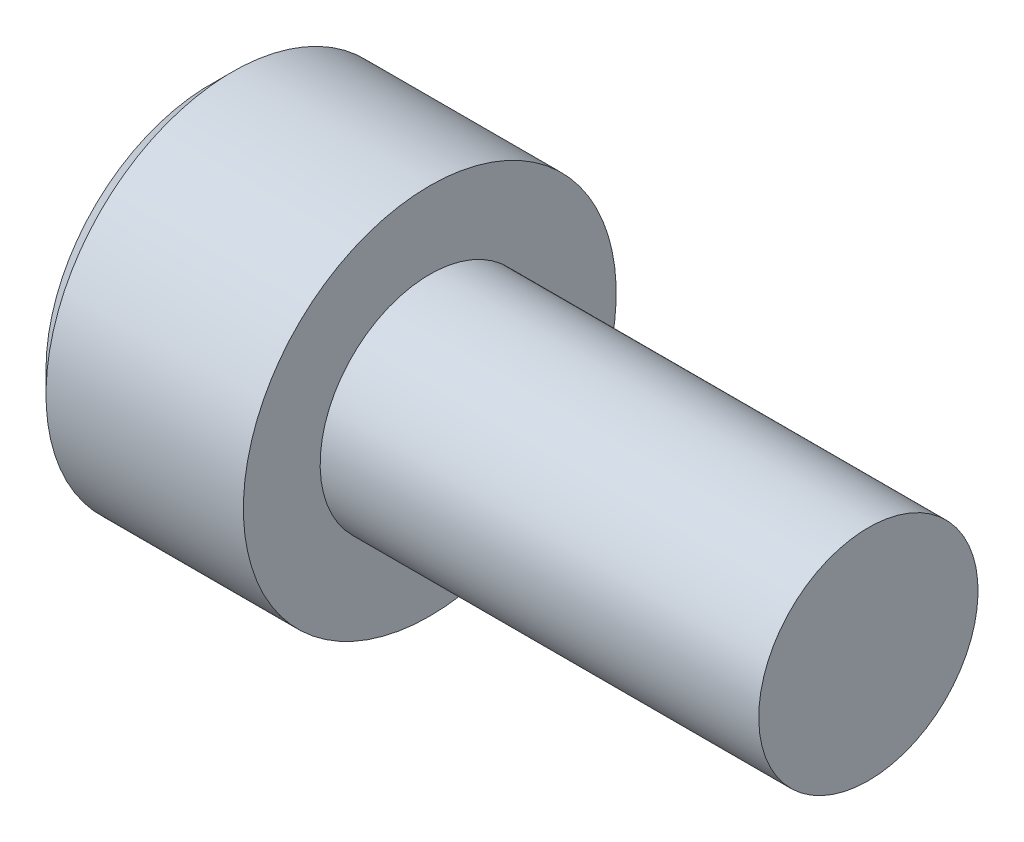
ISO-10303-21;
HEADER;
FILE_DESCRIPTION(('STEP AP214'),'2;1');
FILE_NAME('part.step','',(''),(''),'','','');
FILE_SCHEMA(('AUTOMOTIVE_DESIGN { 1 0 10303 214 1 1 1 1 }'));
ENDSEC;
DATA;
#1=APPLICATION_CONTEXT('core data for automotive mechanical design processes');
#2=APPLICATION_PROTOCOL_DEFINITION('international standard','automotive_design',2000,#1);
#3=PRODUCT_CONTEXT('',#1,'mechanical');
#4=PRODUCT('Part','Part','',(#3));
#5=PRODUCT_RELATED_PRODUCT_CATEGORY('part','',(#4));
#6=PRODUCT_DEFINITION_FORMATION('','',#4);
#7=PRODUCT_DEFINITION_CONTEXT('part definition',#1,'design');
#8=PRODUCT_DEFINITION('design','',#6,#7);
#9=PRODUCT_DEFINITION_SHAPE('','',#8);
#10=(LENGTH_UNIT() NAMED_UNIT(*) SI_UNIT(.MILLI.,.METRE.));
#11=(NAMED_UNIT(*) PLANE_ANGLE_UNIT() SI_UNIT($,.RADIAN.));
#12=(NAMED_UNIT(*) SI_UNIT($,.STERADIAN.) SOLID_ANGLE_UNIT());
#13=UNCERTAINTY_MEASURE_WITH_UNIT(LENGTH_MEASURE(1.E-05),#10,'distance_accuracy_value','');
#14=(GEOMETRIC_REPRESENTATION_CONTEXT(3) GLOBAL_UNCERTAINTY_ASSIGNED_CONTEXT((#13)) GLOBAL_UNIT_ASSIGNED_CONTEXT((#10,
#11,#12)) REPRESENTATION_CONTEXT('',''));
#15=CARTESIAN_POINT('',(0.,0.,0.));
#16=DIRECTION('',(0.,0.,1.));
#17=DIRECTION('',(1.,0.,0.));
#18=AXIS2_PLACEMENT_3D('',#15,#16,#17);
#19=CARTESIAN_POINT('',(-2.5,0.,0.));
#20=DIRECTION('',(-1.,0.,0.));
#21=DIRECTION('',(0.,0.,1.));
#22=AXIS2_PLACEMENT_3D('',#19,#20,#21);
#23=PLANE('',#22);
#24=CARTESIAN_POINT('',(-2.49999999999982,0.,0.));
#25=DIRECTION('',(-1.,0.,0.));
#26=DIRECTION('',(0.,-1.,0.));
#27=AXIS2_PLACEMENT_3D('',#24,#25,#26);
#28=CIRCLE('',#27,2.);
#29=CARTESIAN_POINT('',(-2.49999999999991,1.73205080756888,1.));
#30=VERTEX_POINT('',#29);
#31=CARTESIAN_POINT('',(-2.49999999999991,0.,2.));
#32=VERTEX_POINT('',#31);
#33=EDGE_CURVE('E18',#30,#32,#28,.F.);
#34=ORIENTED_EDGE('',*,*,#33,.T.);
#35=DIRECTION('',(0.,1.,0.));
#36=VECTOR('',#35,1.);
#37=CARTESIAN_POINT('',(-2.5,0.,2.));
#38=LINE('',#37,#36);
#39=CARTESIAN_POINT('',(-2.5,1.15470053837925,2.));
#40=VERTEX_POINT('',#39);
#41=EDGE_CURVE('E83',#32,#40,#38,.T.);
#42=ORIENTED_EDGE('',*,*,#41,.T.);
#43=DIRECTION('',(0.,0.499999999999999,-0.866025403784439));
#44=VECTOR('',#43,1.);
#45=CARTESIAN_POINT('',(-2.5,1.15470053837925,2.));
#46=LINE('',#45,#44);
#47=EDGE_CURVE('E103',#40,#30,#46,.T.);
#48=ORIENTED_EDGE('',*,*,#47,.T.);
#49=EDGE_LOOP('',(#34,#42,#48));
#50=FACE_BOUND('',#49,.T.);
#51=ADVANCED_FACE('F15',(#50),#23,.T.);
#52=CARTESIAN_POINT('',(-2.5,0.,0.));
#53=DIRECTION('',(-1.,0.,0.));
#54=DIRECTION('',(0.,0.,1.));
#55=AXIS2_PLACEMENT_3D('',#52,#53,#54);
#56=PLANE('',#55);
#57=CARTESIAN_POINT('',(-2.49999999999982,0.,0.));
#58=DIRECTION('',(-1.,0.,0.));
#59=DIRECTION('',(0.,-1.,0.));
#60=AXIS2_PLACEMENT_3D('',#57,#58,#59);
#61=CIRCLE('',#60,2.);
#62=CARTESIAN_POINT('',(-2.49999999999991,-1.73205080756888,1.));
#63=VERTEX_POINT('',#62);
#64=EDGE_CURVE('E113',#32,#63,#61,.F.);
#65=ORIENTED_EDGE('',*,*,#64,.T.);
#66=DIRECTION('',(0.,0.499999999999999,0.866025403784439));
#67=VECTOR('',#66,1.);
#68=CARTESIAN_POINT('',(-2.5,-1.73205080756888,1.));
#69=LINE('',#68,#67);
#70=CARTESIAN_POINT('',(-2.5,-1.15470053837925,2.));
#71=VERTEX_POINT('',#70);
#72=EDGE_CURVE('E121',#63,#71,#69,.T.);
#73=ORIENTED_EDGE('',*,*,#72,.T.);
#74=DIRECTION('',(0.,1.,0.));
#75=VECTOR('',#74,1.);
#76=CARTESIAN_POINT('',(-2.5,0.,2.));
#77=LINE('',#76,#75);
#78=EDGE_CURVE('E129',#71,#32,#77,.T.);
#79=ORIENTED_EDGE('',*,*,#78,.T.);
#80=EDGE_LOOP('',(#65,#73,#79));
#81=FACE_BOUND('',#80,.T.);
#82=ADVANCED_FACE('F365',(#81),#56,.T.);
#83=CARTESIAN_POINT('',(-2.5,0.,0.));
#84=DIRECTION('',(-1.,0.,0.));
#85=DIRECTION('',(0.,0.,1.));
#86=AXIS2_PLACEMENT_3D('',#83,#84,#85);
#87=PLANE('',#86);
#88=CARTESIAN_POINT('',(-2.49999999999982,0.,0.));
#89=DIRECTION('',(-1.,0.,0.));
#90=DIRECTION('',(0.,-1.,0.));
#91=AXIS2_PLACEMENT_3D('',#88,#89,#90);
#92=CIRCLE('',#91,2.);
#93=CARTESIAN_POINT('',(-2.49999999999991,0.,-2.));
#94=VERTEX_POINT('',#93);
#95=CARTESIAN_POINT('',(-2.49999999999991,1.73205080756888,-1.));
#96=VERTEX_POINT('',#95);
#97=EDGE_CURVE('E99',#94,#96,#92,.F.);
#98=ORIENTED_EDGE('',*,*,#97,.T.);
#99=DIRECTION('',(0.,-0.5,-0.866025403784439));
#100=VECTOR('',#99,1.);
#101=CARTESIAN_POINT('',(-2.5,1.73205080756888,-1.));
#102=LINE('',#101,#100);
#103=CARTESIAN_POINT('',(-2.5,1.15470053837925,-2.));
#104=VERTEX_POINT('',#103);
#105=EDGE_CURVE('E114',#96,#104,#102,.T.);
#106=ORIENTED_EDGE('',*,*,#105,.T.);
#107=DIRECTION('',(0.,1.,0.));
#108=VECTOR('',#107,1.);
#109=CARTESIAN_POINT('',(-2.5,0.,-2.));
#110=LINE('',#109,#108);
#111=EDGE_CURVE('E117',#104,#94,#110,.F.);
#112=ORIENTED_EDGE('',*,*,#111,.T.);
#113=EDGE_LOOP('',(#98,#106,#112));
#114=FACE_BOUND('',#113,.T.);
#115=ADVANCED_FACE('F356',(#114),#87,.T.);
#116=CARTESIAN_POINT('',(-2.49999999999995,0.,0.));
#117=DIRECTION('',(-1.,0.,0.));
#118=DIRECTION('',(0.,-1.,0.));
#119=AXIS2_PLACEMENT_3D('',#116,#117,#118);
#120=CONICAL_SURFACE('',#119,2.00000000000022,1.04719755119663);
#121=CARTESIAN_POINT('',(-1.3452994616206,2.22044604925031E-13,0.));
#122=VERTEX_POINT('',#121);
#123=VERTEX_LOOP('',#122);
#124=FACE_BOUND('',#123,.T.);
#125=ORIENTED_EDGE('',*,*,#33,.F.);
#126=CARTESIAN_POINT('',(-2.49999999999982,0.,0.));
#127=DIRECTION('',(-1.,0.,0.));
#128=DIRECTION('',(0.,-1.,0.));
#129=AXIS2_PLACEMENT_3D('',#126,#127,#128);
#130=CIRCLE('',#129,2.);
#131=EDGE_CURVE('E89',#96,#30,#130,.F.);
#132=ORIENTED_EDGE('',*,*,#131,.F.);
#133=ORIENTED_EDGE('',*,*,#97,.F.);
#134=CARTESIAN_POINT('',(-2.49999999999982,0.,0.));
#135=DIRECTION('',(-1.,0.,0.));
#136=DIRECTION('',(0.,-1.,0.));
#137=AXIS2_PLACEMENT_3D('',#134,#135,#136);
#138=CIRCLE('',#137,2.);
#139=CARTESIAN_POINT('',(-2.49999999999991,-1.73205080756888,-0.999999999999999));
#140=VERTEX_POINT('',#139);
#141=EDGE_CURVE('E151',#140,#94,#138,.F.);
#142=ORIENTED_EDGE('',*,*,#141,.F.);
#143=CARTESIAN_POINT('',(-2.49999999999982,0.,0.));
#144=DIRECTION('',(-1.,0.,0.));
#145=DIRECTION('',(0.,-1.,0.));
#146=AXIS2_PLACEMENT_3D('',#143,#144,#145);
#147=CIRCLE('',#146,2.);
#148=EDGE_CURVE('E115',#63,#140,#147,.F.);
#149=ORIENTED_EDGE('',*,*,#148,.F.);
#150=ORIENTED_EDGE('',*,*,#64,.F.);
#151=EDGE_LOOP('',(#125,#132,#133,#142,#149,#150));
#152=FACE_BOUND('',#151,.T.);
#153=ADVANCED_FACE('F111',(#124,#152),#120,.F.);
#154=CARTESIAN_POINT('',(-2.5,0.,0.));
#155=DIRECTION('',(-1.,0.,0.));
#156=DIRECTION('',(0.,0.,1.));
#157=AXIS2_PLACEMENT_3D('',#154,#155,#156);
#158=PLANE('',#157);
#159=ORIENTED_EDGE('',*,*,#141,.T.);
#160=DIRECTION('',(0.,1.,0.));
#161=VECTOR('',#160,1.);
#162=CARTESIAN_POINT('',(-2.5,1.15470053837925,-2.));
#163=LINE('',#162,#161);
#164=CARTESIAN_POINT('',(-2.5,-1.15470053837925,-2.));
#165=VERTEX_POINT('',#164);
#166=EDGE_CURVE('E153',#94,#165,#163,.F.);
#167=ORIENTED_EDGE('',*,*,#166,.T.);
#168=DIRECTION('',(0.,-0.499999999999999,0.866025403784439));
#169=VECTOR('',#168,1.);
#170=CARTESIAN_POINT('',(-2.5,-1.15470053837925,-2.));
#171=LINE('',#170,#169);
#172=EDGE_CURVE('E98',#165,#140,#171,.T.);
#173=ORIENTED_EDGE('',*,*,#172,.T.);
#174=EDGE_LOOP('',(#159,#167,#173));
#175=FACE_BOUND('',#174,.T.);
#176=ADVANCED_FACE('F175',(#175),#158,.T.);
#177=CARTESIAN_POINT('',(-2.5,0.,0.));
#178=DIRECTION('',(-1.,0.,0.));
#179=DIRECTION('',(0.,0.,1.));
#180=AXIS2_PLACEMENT_3D('',#177,#178,#179);
#181=PLANE('',#180);
#182=ORIENTED_EDGE('',*,*,#148,.T.);
#183=DIRECTION('',(0.,0.5,-0.866025403784439));
#184=VECTOR('',#183,1.);
#185=CARTESIAN_POINT('',(-2.5,-1.15470053837925,-2.));
#186=LINE('',#185,#184);
#187=CARTESIAN_POINT('',(-2.5,-2.3094010767585,0.));
#188=VERTEX_POINT('',#187);
#189=EDGE_CURVE('E160',#140,#188,#186,.F.);
#190=ORIENTED_EDGE('',*,*,#189,.T.);
#191=DIRECTION('',(0.,-0.5,-0.866025403784439));
#192=VECTOR('',#191,1.);
#193=CARTESIAN_POINT('',(-2.5,-2.3094010767585,0.));
#194=LINE('',#193,#192);
#195=EDGE_CURVE('E139',#188,#63,#194,.F.);
#196=ORIENTED_EDGE('',*,*,#195,.T.);
#197=EDGE_LOOP('',(#182,#190,#196));
#198=FACE_BOUND('',#197,.T.);
#199=ADVANCED_FACE('F159',(#198),#181,.T.);
#200=CARTESIAN_POINT('',(-2.5,0.,0.));
#201=DIRECTION('',(-1.,0.,0.));
#202=DIRECTION('',(0.,0.,1.));
#203=AXIS2_PLACEMENT_3D('',#200,#201,#202);
#204=PLANE('',#203);
#205=ORIENTED_EDGE('',*,*,#131,.T.);
#206=DIRECTION('',(0.,-0.5,0.866025403784439));
#207=VECTOR('',#206,1.);
#208=CARTESIAN_POINT('',(-2.5,1.15470053837925,2.));
#209=LINE('',#208,#207);
#210=CARTESIAN_POINT('',(-2.5,2.3094010767585,0.));
#211=VERTEX_POINT('',#210);
#212=EDGE_CURVE('E92',#30,#211,#209,.F.);
#213=ORIENTED_EDGE('',*,*,#212,.T.);
#214=DIRECTION('',(0.,0.5,0.866025403784439));
#215=VECTOR('',#214,1.);
#216=CARTESIAN_POINT('',(-2.5,2.3094010767585,0.));
#217=LINE('',#216,#215);
#218=EDGE_CURVE('E94',#211,#96,#217,.F.);
#219=ORIENTED_EDGE('',*,*,#218,.T.);
#220=EDGE_LOOP('',(#205,#213,#219));
#221=FACE_BOUND('',#220,.T.);
#222=ADVANCED_FACE('F91',(#221),#204,.T.);
#223=CARTESIAN_POINT('',(-2.5,1.15470053837925,-2.));
#224=DIRECTION('',(0.,0.,-1.));
#225=DIRECTION('',(0.,1.,0.));
#226=AXIS2_PLACEMENT_3D('',#223,#224,#225);
#227=PLANE('',#226);
#228=DIRECTION('',(1.,0.,0.));
#229=VECTOR('',#228,1.);
#230=CARTESIAN_POINT('',(-2.5,-1.15470053837925,-2.));
#231=LINE('',#230,#229);
#232=CARTESIAN_POINT('',(-5.,-1.15470053837925,-2.));
#233=VERTEX_POINT('',#232);
#234=EDGE_CURVE('E124',#233,#165,#231,.T.);
#235=ORIENTED_EDGE('',*,*,#234,.T.);
#236=ORIENTED_EDGE('',*,*,#166,.F.);
#237=ORIENTED_EDGE('',*,*,#111,.F.);
#238=DIRECTION('',(1.,0.,0.));
#239=VECTOR('',#238,1.);
#240=CARTESIAN_POINT('',(-2.5,1.15470053837925,-2.));
#241=LINE('',#240,#239);
#242=CARTESIAN_POINT('',(-5.,1.15470053837925,-2.));
#243=VERTEX_POINT('',#242);
#244=EDGE_CURVE('E132',#104,#243,#241,.F.);
#245=ORIENTED_EDGE('',*,*,#244,.T.);
#246=DIRECTION('',(0.,1.,0.));
#247=VECTOR('',#246,1.);
#248=CARTESIAN_POINT('',(-5.,0.,-2.));
#249=LINE('',#248,#247);
#250=EDGE_CURVE('E135',#243,#233,#249,.F.);
#251=ORIENTED_EDGE('',*,*,#250,.T.);
#252=EDGE_LOOP('',(#235,#236,#237,#245,#251));
#253=FACE_BOUND('',#252,.T.);
#254=ADVANCED_FACE('F183',(#253),#227,.F.);
#255=CARTESIAN_POINT('',(-2.5,-1.15470053837925,-2.));
#256=DIRECTION('',(0.,-0.866025403784439,-0.5));
#257=DIRECTION('',(0.,0.5,-0.866025403784439));
#258=AXIS2_PLACEMENT_3D('',#255,#256,#257);
#259=PLANE('',#258);
#260=DIRECTION('',(1.,0.,0.));
#261=VECTOR('',#260,1.);
#262=CARTESIAN_POINT('',(-2.5,-2.3094010767585,0.));
#263=LINE('',#262,#261);
#264=CARTESIAN_POINT('',(-5.,-2.3094010767585,0.));
#265=VERTEX_POINT('',#264);
#266=EDGE_CURVE('E171',#265,#188,#263,.T.);
#267=ORIENTED_EDGE('',*,*,#266,.T.);
#268=ORIENTED_EDGE('',*,*,#189,.F.);
#269=ORIENTED_EDGE('',*,*,#172,.F.);
#270=ORIENTED_EDGE('',*,*,#234,.F.);
#271=DIRECTION('',(0.,-0.5,0.866025403784439));
#272=VECTOR('',#271,1.);
#273=CARTESIAN_POINT('',(-5.,-1.15470053837925,-2.));
#274=LINE('',#273,#272);
#275=EDGE_CURVE('E186',#233,#265,#274,.T.);
#276=ORIENTED_EDGE('',*,*,#275,.T.);
#277=EDGE_LOOP('',(#267,#268,#269,#270,#276));
#278=FACE_BOUND('',#277,.T.);
#279=ADVANCED_FACE('F166',(#278),#259,.F.);
#280=CARTESIAN_POINT('',(-2.5,-2.3094010767585,0.));
#281=DIRECTION('',(0.,-0.866025403784439,0.5));
#282=DIRECTION('',(0.,-0.5,-0.866025403784439));
#283=AXIS2_PLACEMENT_3D('',#280,#281,#282);
#284=PLANE('',#283);
#285=DIRECTION('',(1.,0.,0.));
#286=VECTOR('',#285,1.);
#287=CARTESIAN_POINT('',(-2.5,-1.15470053837925,2.));
#288=LINE('',#287,#286);
#289=CARTESIAN_POINT('',(-5.,-1.15470053837925,2.));
#290=VERTEX_POINT('',#289);
#291=EDGE_CURVE('E136',#290,#71,#288,.T.);
#292=ORIENTED_EDGE('',*,*,#291,.T.);
#293=ORIENTED_EDGE('',*,*,#72,.F.);
#294=ORIENTED_EDGE('',*,*,#195,.F.);
#295=ORIENTED_EDGE('',*,*,#266,.F.);
#296=DIRECTION('',(0.,0.5,0.866025403784438));
#297=VECTOR('',#296,1.);
#298=CARTESIAN_POINT('',(-5.,-2.3094010767585,0.));
#299=LINE('',#298,#297);
#300=EDGE_CURVE('E179',#265,#290,#299,.T.);
#301=ORIENTED_EDGE('',*,*,#300,.T.);
#302=EDGE_LOOP('',(#292,#293,#294,#295,#301));
#303=FACE_BOUND('',#302,.T.);
#304=ADVANCED_FACE('F305',(#303),#284,.F.);
#305=CARTESIAN_POINT('',(-2.5,-1.15470053837925,2.));
#306=DIRECTION('',(0.,0.,1.));
#307=DIRECTION('',(1.,0.,0.));
#308=AXIS2_PLACEMENT_3D('',#305,#306,#307);
#309=PLANE('',#308);
#310=DIRECTION('',(1.,0.,0.));
#311=VECTOR('',#310,1.);
#312=CARTESIAN_POINT('',(-2.5,1.15470053837925,2.));
#313=LINE('',#312,#311);
#314=CARTESIAN_POINT('',(-5.,1.15470053837925,2.));
#315=VERTEX_POINT('',#314);
#316=EDGE_CURVE('E105',#315,#40,#313,.T.);
#317=ORIENTED_EDGE('',*,*,#316,.T.);
#318=ORIENTED_EDGE('',*,*,#41,.F.);
#319=ORIENTED_EDGE('',*,*,#78,.F.);
#320=ORIENTED_EDGE('',*,*,#291,.F.);
#321=DIRECTION('',(0.,1.,0.));
#322=VECTOR('',#321,1.);
#323=CARTESIAN_POINT('',(-5.,0.,2.));
#324=LINE('',#323,#322);
#325=EDGE_CURVE('E194',#290,#315,#324,.T.);
#326=ORIENTED_EDGE('',*,*,#325,.T.);
#327=EDGE_LOOP('',(#317,#318,#319,#320,#326));
#328=FACE_BOUND('',#327,.T.);
#329=ADVANCED_FACE('F297',(#328),#309,.F.);
#330=CARTESIAN_POINT('',(-2.5,1.15470053837925,2.));
#331=DIRECTION('',(0.,0.866025403784439,0.5));
#332=DIRECTION('',(0.,-0.5,0.866025403784439));
#333=AXIS2_PLACEMENT_3D('',#330,#331,#332);
#334=PLANE('',#333);
#335=DIRECTION('',(1.,0.,0.));
#336=VECTOR('',#335,1.);
#337=CARTESIAN_POINT('',(-2.5,2.3094010767585,0.));
#338=LINE('',#337,#336);
#339=CARTESIAN_POINT('',(-5.,2.3094010767585,0.));
#340=VERTEX_POINT('',#339);
#341=EDGE_CURVE('E104',#340,#211,#338,.T.);
#342=ORIENTED_EDGE('',*,*,#341,.T.);
#343=ORIENTED_EDGE('',*,*,#212,.F.);
#344=ORIENTED_EDGE('',*,*,#47,.F.);
#345=ORIENTED_EDGE('',*,*,#316,.F.);
#346=DIRECTION('',(0.,0.5,-0.866025403784439));
#347=VECTOR('',#346,1.);
#348=CARTESIAN_POINT('',(-5.,1.15470053837925,2.));
#349=LINE('',#348,#347);
#350=EDGE_CURVE('E33',#315,#340,#349,.T.);
#351=ORIENTED_EDGE('',*,*,#350,.T.);
#352=EDGE_LOOP('',(#342,#343,#344,#345,#351));
#353=FACE_BOUND('',#352,.T.);
#354=ADVANCED_FACE('F102',(#353),#334,.F.);
#355=CARTESIAN_POINT('',(-2.5,2.3094010767585,0.));
#356=DIRECTION('',(0.,0.866025403784439,-0.5));
#357=DIRECTION('',(0.,0.5,0.866025403784439));
#358=AXIS2_PLACEMENT_3D('',#355,#356,#357);
#359=PLANE('',#358);
#360=ORIENTED_EDGE('',*,*,#244,.F.);
#361=ORIENTED_EDGE('',*,*,#105,.F.);
#362=ORIENTED_EDGE('',*,*,#218,.F.);
#363=ORIENTED_EDGE('',*,*,#341,.F.);
#364=DIRECTION('',(0.,-0.5,-0.866025403784439));
#365=VECTOR('',#364,1.);
#366=CARTESIAN_POINT('',(-5.,2.3094010767585,0.));
#367=LINE('',#366,#365);
#368=EDGE_CURVE('E150',#340,#243,#367,.T.);
#369=ORIENTED_EDGE('',*,*,#368,.T.);
#370=EDGE_LOOP('',(#360,#361,#362,#363,#369));
#371=FACE_BOUND('',#370,.T.);
#372=ADVANCED_FACE('F217',(#371),#359,.F.);
#373=CARTESIAN_POINT('',(-5.,0.,0.));
#374=DIRECTION('',(1.,0.,0.));
#375=DIRECTION('',(0.,1.,0.));
#376=AXIS2_PLACEMENT_3D('',#373,#374,#375);
#377=PLANE('',#376);
#378=ORIENTED_EDGE('',*,*,#350,.F.);
#379=ORIENTED_EDGE('',*,*,#325,.F.);
#380=ORIENTED_EDGE('',*,*,#300,.F.);
#381=ORIENTED_EDGE('',*,*,#275,.F.);
#382=ORIENTED_EDGE('',*,*,#250,.F.);
#383=ORIENTED_EDGE('',*,*,#368,.F.);
#384=EDGE_LOOP('',(#378,#379,#380,#381,#382,#383));
#385=FACE_BOUND('',#384,.T.);
#386=CARTESIAN_POINT('',(-4.99999999993861,0.,0.));
#387=DIRECTION('',(1.,0.,0.));
#388=DIRECTION('',(0.,0.,-1.));
#389=AXIS2_PLACEMENT_3D('',#386,#387,#388);
#390=CIRCLE('',#389,3.74999999996817);
#391=CARTESIAN_POINT('',(-4.99999999993861,0.,-3.74999999996817));
#392=VERTEX_POINT('',#391);
#393=EDGE_CURVE('E147',#392,#392,#390,.T.);
#394=ORIENTED_EDGE('',*,*,#393,.F.);
#395=EDGE_LOOP('',(#394));
#396=FACE_BOUND('',#395,.T.);
#397=ADVANCED_FACE('F189',(#385,#396),#377,.F.);
#398=CARTESIAN_POINT('',(-4.49999999995043,0.,0.));
#399=DIRECTION('',(1.,0.,0.));
#400=DIRECTION('',(0.,0.,-1.));
#401=AXIS2_PLACEMENT_3D('',#398,#399,#400);
#402=CONICAL_SURFACE('',#401,4.25000000001319,0.785398163454292);
#403=CARTESIAN_POINT('',(-4.5,0.,0.));
#404=DIRECTION('',(-1.,0.,0.));
#405=DIRECTION('',(0.,-1.,0.));
#406=AXIS2_PLACEMENT_3D('',#403,#404,#405);
#407=CIRCLE('',#406,4.25);
#408=CARTESIAN_POINT('',(-4.5,-4.25,0.));
#409=VERTEX_POINT('',#408);
#410=EDGE_CURVE('E146',#409,#409,#407,.F.);
#411=ORIENTED_EDGE('',*,*,#410,.F.);
#412=EDGE_LOOP('',(#411));
#413=FACE_BOUND('',#412,.T.);
#414=ORIENTED_EDGE('',*,*,#393,.T.);
#415=EDGE_LOOP('',(#414));
#416=FACE_BOUND('',#415,.T.);
#417=ADVANCED_FACE('F211',(#413,#416),#402,.T.);
#418=CARTESIAN_POINT('',(-5.,0.,0.));
#419=DIRECTION('',(-1.,0.,0.));
#420=DIRECTION('',(0.,-1.,0.));
#421=AXIS2_PLACEMENT_3D('',#418,#419,#420);
#422=CYLINDRICAL_SURFACE('',#421,4.25);
#423=ORIENTED_EDGE('',*,*,#410,.T.);
#424=EDGE_LOOP('',(#423));
#425=FACE_BOUND('',#424,.T.);
#426=CARTESIAN_POINT('',(0.,0.,0.));
#427=DIRECTION('',(-1.,0.,0.));
#428=DIRECTION('',(0.,-1.,0.));
#429=AXIS2_PLACEMENT_3D('',#426,#427,#428);
#430=CIRCLE('',#429,4.25);
#431=CARTESIAN_POINT('',(0.,-4.25,0.));
#432=VERTEX_POINT('',#431);
#433=EDGE_CURVE('E143',#432,#432,#430,.T.);
#434=ORIENTED_EDGE('',*,*,#433,.T.);
#435=EDGE_LOOP('',(#434));
#436=FACE_BOUND('',#435,.T.);
#437=ADVANCED_FACE('F208',(#425,#436),#422,.T.);
#438=CARTESIAN_POINT('',(10.,2.5,0.));
#439=DIRECTION('',(-1.,0.,0.));
#440=DIRECTION('',(0.,-1.,0.));
#441=AXIS2_PLACEMENT_3D('',#438,#439,#440);
#442=PLANE('',#441);
#443=CARTESIAN_POINT('',(10.,0.,0.));
#444=DIRECTION('',(-1.,0.,0.));
#445=DIRECTION('',(0.,-1.,0.));
#446=AXIS2_PLACEMENT_3D('',#443,#444,#445);
#447=CIRCLE('',#446,2.5);
#448=CARTESIAN_POINT('',(10.,-2.5,0.));
#449=VERTEX_POINT('',#448);
#450=EDGE_CURVE('E24',#449,#449,#447,.T.);
#451=ORIENTED_EDGE('',*,*,#450,.F.);
#452=EDGE_LOOP('',(#451));
#453=FACE_BOUND('',#452,.T.);
#454=ADVANCED_FACE('F233',(#453),#442,.F.);
#455=CARTESIAN_POINT('',(0.,2.5,0.));
#456=DIRECTION('',(-1.,0.,0.));
#457=DIRECTION('',(0.,-1.,0.));
#458=AXIS2_PLACEMENT_3D('',#455,#456,#457);
#459=PLANE('',#458);
#460=CARTESIAN_POINT('',(0.,0.,0.));
#461=DIRECTION('',(-1.,0.,0.));
#462=DIRECTION('',(0.,-1.,0.));
#463=AXIS2_PLACEMENT_3D('',#460,#461,#462);
#464=CIRCLE('',#463,2.5);
#465=CARTESIAN_POINT('',(0.,-2.5,0.));
#466=VERTEX_POINT('',#465);
#467=EDGE_CURVE('E10',#466,#466,#464,.F.);
#468=ORIENTED_EDGE('',*,*,#467,.F.);
#469=EDGE_LOOP('',(#468));
#470=FACE_BOUND('',#469,.T.);
#471=ORIENTED_EDGE('',*,*,#433,.F.);
#472=EDGE_LOOP('',(#471));
#473=FACE_BOUND('',#472,.T.);
#474=ADVANCED_FACE('F227',(#470,#473),#459,.F.);
#475=CARTESIAN_POINT('',(-5.,0.,0.));
#476=DIRECTION('',(-1.,0.,0.));
#477=DIRECTION('',(0.,-1.,0.));
#478=AXIS2_PLACEMENT_3D('',#475,#476,#477);
#479=CYLINDRICAL_SURFACE('',#478,2.5);
#480=ORIENTED_EDGE('',*,*,#467,.T.);
#481=EDGE_LOOP('',(#480));
#482=FACE_BOUND('',#481,.T.);
#483=ORIENTED_EDGE('',*,*,#450,.T.);
#484=EDGE_LOOP('',(#483));
#485=FACE_BOUND('',#484,.T.);
#486=ADVANCED_FACE('F225',(#482,#485),#479,.T.);
#487=CLOSED_SHELL('',(#51,#82,#115,#153,#176,#199,#222,#254,#279,#304,#329,#354,#372,#397,#417,
#437,#454,#474,#486));
#488=MANIFOLD_SOLID_BREP('B1',#487);
#489=ADVANCED_BREP_SHAPE_REPRESENTATION('',(#18,#488),#14);
#490=SHAPE_DEFINITION_REPRESENTATION(#9,#489);
ENDSEC;
END-ISO-10303-21;
